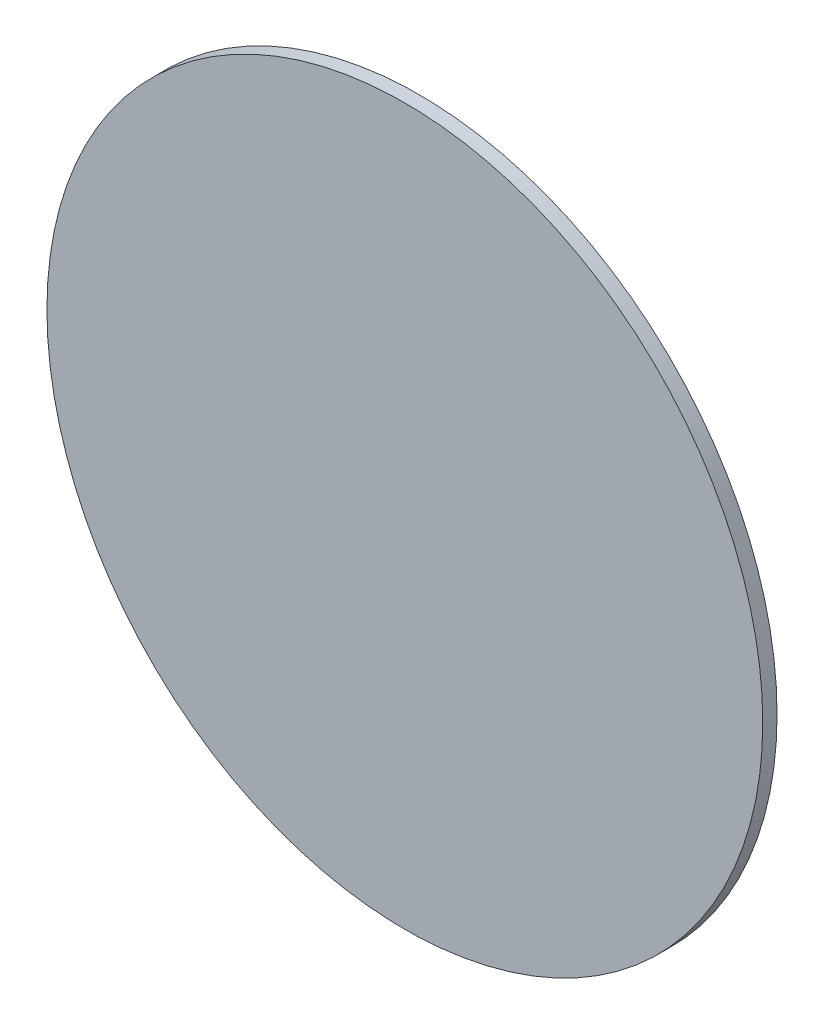
ISO-10303-21;
HEADER;
FILE_DESCRIPTION(('STEP AP214'),'2;1');
FILE_NAME('part.step','',(''),(''),'','','');
FILE_SCHEMA(('AUTOMOTIVE_DESIGN { 1 0 10303 214 1 1 1 1 }'));
ENDSEC;
DATA;
#1=APPLICATION_CONTEXT('core data for automotive mechanical design processes');
#2=APPLICATION_PROTOCOL_DEFINITION('international standard','automotive_design',2000,#1);
#3=PRODUCT_CONTEXT('',#1,'mechanical');
#4=PRODUCT('Part','Part','',(#3));
#5=PRODUCT_RELATED_PRODUCT_CATEGORY('part','',(#4));
#6=PRODUCT_DEFINITION_FORMATION('','',#4);
#7=PRODUCT_DEFINITION_CONTEXT('part definition',#1,'design');
#8=PRODUCT_DEFINITION('design','',#6,#7);
#9=PRODUCT_DEFINITION_SHAPE('','',#8);
#10=(LENGTH_UNIT() NAMED_UNIT(*) SI_UNIT(.MILLI.,.METRE.));
#11=(NAMED_UNIT(*) PLANE_ANGLE_UNIT() SI_UNIT($,.RADIAN.));
#12=(NAMED_UNIT(*) SI_UNIT($,.STERADIAN.) SOLID_ANGLE_UNIT());
#13=UNCERTAINTY_MEASURE_WITH_UNIT(LENGTH_MEASURE(1.E-05),#10,'distance_accuracy_value','');
#14=(GEOMETRIC_REPRESENTATION_CONTEXT(3) GLOBAL_UNCERTAINTY_ASSIGNED_CONTEXT((#13)) GLOBAL_UNIT_ASSIGNED_CONTEXT((#10,
#11,#12)) REPRESENTATION_CONTEXT('',''));
#15=CARTESIAN_POINT('',(0.,0.,0.));
#16=DIRECTION('',(0.,0.,1.));
#17=DIRECTION('',(1.,0.,0.));
#18=AXIS2_PLACEMENT_3D('',#15,#16,#17);
#19=CARTESIAN_POINT('',(0.,0.,0.254));
#20=DIRECTION('',(0.,0.,-1.));
#21=DIRECTION('',(-1.,0.,0.));
#22=AXIS2_PLACEMENT_3D('',#19,#20,#21);
#23=CYLINDRICAL_SURFACE('',#22,6.35);
#24=CARTESIAN_POINT('',(0.,0.,0.254));
#25=DIRECTION('',(0.,0.,1.));
#26=DIRECTION('',(1.,0.,0.));
#27=AXIS2_PLACEMENT_3D('',#24,#25,#26);
#28=CIRCLE('',#27,6.35);
#29=CARTESIAN_POINT('',(6.35,0.,0.254));
#30=VERTEX_POINT('',#29);
#31=EDGE_CURVE('E10',#30,#30,#28,.T.);
#32=ORIENTED_EDGE('',*,*,#31,.F.);
#33=EDGE_LOOP('',(#32));
#34=FACE_BOUND('',#33,.T.);
#35=CARTESIAN_POINT('',(0.,0.,0.));
#36=DIRECTION('',(0.,0.,1.));
#37=DIRECTION('',(1.,0.,0.));
#38=AXIS2_PLACEMENT_3D('',#35,#36,#37);
#39=CIRCLE('',#38,6.35);
#40=CARTESIAN_POINT('',(6.35,0.,0.));
#41=VERTEX_POINT('',#40);
#42=EDGE_CURVE('E37',#41,#41,#39,.T.);
#43=ORIENTED_EDGE('',*,*,#42,.T.);
#44=EDGE_LOOP('',(#43));
#45=FACE_BOUND('',#44,.T.);
#46=ADVANCED_FACE('F34',(#34,#45),#23,.T.);
#47=CARTESIAN_POINT('',(0.,0.,0.254));
#48=DIRECTION('',(0.,0.,1.));
#49=DIRECTION('',(1.,0.,0.));
#50=AXIS2_PLACEMENT_3D('',#47,#48,#49);
#51=PLANE('',#50);
#52=ORIENTED_EDGE('',*,*,#31,.T.);
#53=EDGE_LOOP('',(#52));
#54=FACE_BOUND('',#53,.T.);
#55=ADVANCED_FACE('F49',(#54),#51,.T.);
#56=CARTESIAN_POINT('',(0.,0.,0.));
#57=DIRECTION('',(0.,0.,1.));
#58=DIRECTION('',(1.,0.,0.));
#59=AXIS2_PLACEMENT_3D('',#56,#57,#58);
#60=PLANE('',#59);
#61=ORIENTED_EDGE('',*,*,#42,.F.);
#62=EDGE_LOOP('',(#61));
#63=FACE_BOUND('',#62,.T.);
#64=ADVANCED_FACE('F47',(#63),#60,.F.);
#65=CLOSED_SHELL('',(#46,#55,#64));
#66=MANIFOLD_SOLID_BREP('B2',#65);
#67=ADVANCED_BREP_SHAPE_REPRESENTATION('',(#18,#66),#14);
#68=SHAPE_DEFINITION_REPRESENTATION(#9,#67);
ENDSEC;
END-ISO-10303-21;
